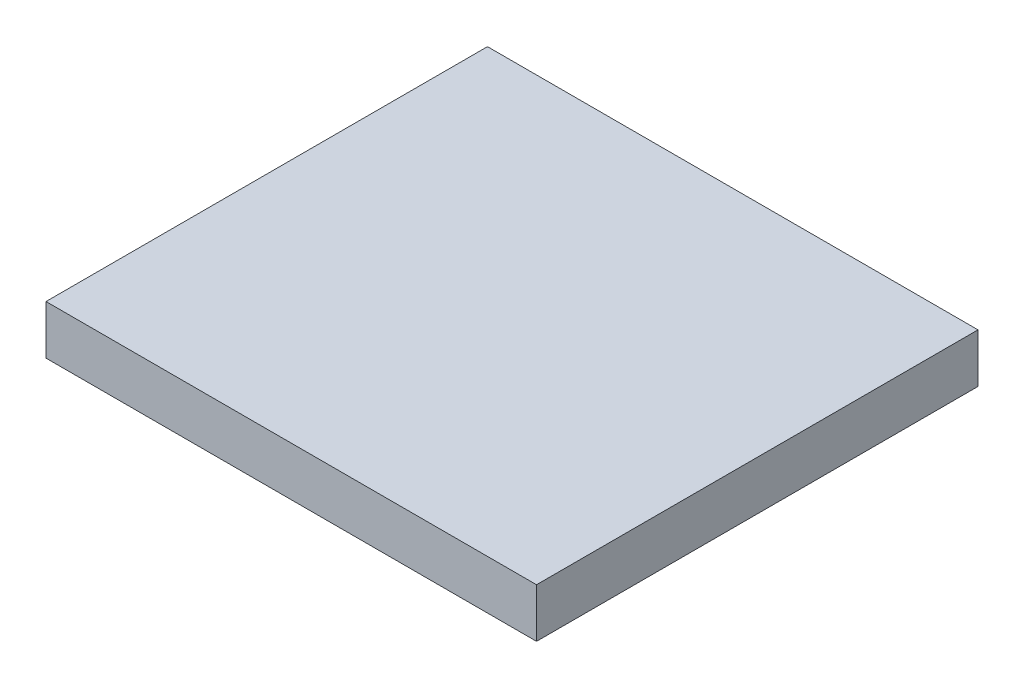
ISO-10303-21;
HEADER;
FILE_DESCRIPTION(('STEP AP214'),'2;1');
FILE_NAME('part.step','',(''),(''),'','','');
FILE_SCHEMA(('AUTOMOTIVE_DESIGN { 1 0 10303 214 1 1 1 1 }'));
ENDSEC;
DATA;
#1=APPLICATION_CONTEXT('core data for automotive mechanical design processes');
#2=APPLICATION_PROTOCOL_DEFINITION('international standard','automotive_design',2000,#1);
#3=PRODUCT_CONTEXT('',#1,'mechanical');
#4=PRODUCT('Part','Part','',(#3));
#5=PRODUCT_RELATED_PRODUCT_CATEGORY('part','',(#4));
#6=PRODUCT_DEFINITION_FORMATION('','',#4);
#7=PRODUCT_DEFINITION_CONTEXT('part definition',#1,'design');
#8=PRODUCT_DEFINITION('design','',#6,#7);
#9=PRODUCT_DEFINITION_SHAPE('','',#8);
#10=(LENGTH_UNIT() NAMED_UNIT(*) SI_UNIT(.MILLI.,.METRE.));
#11=(NAMED_UNIT(*) PLANE_ANGLE_UNIT() SI_UNIT($,.RADIAN.));
#12=(NAMED_UNIT(*) SI_UNIT($,.STERADIAN.) SOLID_ANGLE_UNIT());
#13=UNCERTAINTY_MEASURE_WITH_UNIT(LENGTH_MEASURE(1.E-05),#10,'distance_accuracy_value','');
#14=(GEOMETRIC_REPRESENTATION_CONTEXT(3) GLOBAL_UNCERTAINTY_ASSIGNED_CONTEXT((#13)) GLOBAL_UNIT_ASSIGNED_CONTEXT((#10,
#11,#12)) REPRESENTATION_CONTEXT('',''));
#15=CARTESIAN_POINT('',(0.,0.,0.));
#16=DIRECTION('',(0.,0.,1.));
#17=DIRECTION('',(1.,0.,0.));
#18=AXIS2_PLACEMENT_3D('',#15,#16,#17);
#19=CARTESIAN_POINT('',(0.,10.,0.));
#20=DIRECTION('',(1.,0.,0.));
#21=DIRECTION('',(0.,0.,-1.));
#22=AXIS2_PLACEMENT_3D('',#19,#20,#21);
#23=PLANE('',#22);
#24=DIRECTION('',(0.,0.,1.));
#25=VECTOR('',#24,1.);
#26=CARTESIAN_POINT('',(0.,0.,0.));
#27=LINE('',#26,#25);
#28=CARTESIAN_POINT('',(0.,0.,-90.));
#29=VERTEX_POINT('',#28);
#30=CARTESIAN_POINT('',(0.,0.,0.));
#31=VERTEX_POINT('',#30);
#32=EDGE_CURVE('E105',#29,#31,#27,.T.);
#33=ORIENTED_EDGE('',*,*,#32,.T.);
#34=DIRECTION('',(0.,-1.,0.));
#35=VECTOR('',#34,1.);
#36=CARTESIAN_POINT('',(0.,10.,0.));
#37=LINE('',#36,#35);
#38=CARTESIAN_POINT('',(0.,10.,0.));
#39=VERTEX_POINT('',#38);
#40=EDGE_CURVE('E11',#39,#31,#37,.T.);
#41=ORIENTED_EDGE('',*,*,#40,.F.);
#42=DIRECTION('',(0.,0.,1.));
#43=VECTOR('',#42,1.);
#44=CARTESIAN_POINT('',(0.,10.,0.));
#45=LINE('',#44,#43);
#46=CARTESIAN_POINT('',(0.,10.,-90.));
#47=VERTEX_POINT('',#46);
#48=EDGE_CURVE('E89',#47,#39,#45,.T.);
#49=ORIENTED_EDGE('',*,*,#48,.F.);
#50=DIRECTION('',(0.,-1.,0.));
#51=VECTOR('',#50,1.);
#52=CARTESIAN_POINT('',(0.,10.,-90.));
#53=LINE('',#52,#51);
#54=EDGE_CURVE('E101',#47,#29,#53,.T.);
#55=ORIENTED_EDGE('',*,*,#54,.T.);
#56=EDGE_LOOP('',(#33,#41,#49,#55));
#57=FACE_BOUND('',#56,.T.);
#58=ADVANCED_FACE('F37',(#57),#23,.F.);
#59=CARTESIAN_POINT('',(0.,10.,0.));
#60=DIRECTION('',(0.,0.,-1.));
#61=DIRECTION('',(-1.,0.,0.));
#62=AXIS2_PLACEMENT_3D('',#59,#60,#61);
#63=PLANE('',#62);
#64=DIRECTION('',(1.,0.,0.));
#65=VECTOR('',#64,1.);
#66=CARTESIAN_POINT('',(0.,0.,0.));
#67=LINE('',#66,#65);
#68=CARTESIAN_POINT('',(100.,0.,0.));
#69=VERTEX_POINT('',#68);
#70=EDGE_CURVE('E94',#31,#69,#67,.T.);
#71=ORIENTED_EDGE('',*,*,#70,.T.);
#72=DIRECTION('',(0.,-1.,0.));
#73=VECTOR('',#72,1.);
#74=CARTESIAN_POINT('',(100.,10.,0.));
#75=LINE('',#74,#73);
#76=CARTESIAN_POINT('',(100.,10.,0.));
#77=VERTEX_POINT('',#76);
#78=EDGE_CURVE('E46',#77,#69,#75,.T.);
#79=ORIENTED_EDGE('',*,*,#78,.F.);
#80=DIRECTION('',(1.,0.,0.));
#81=VECTOR('',#80,1.);
#82=CARTESIAN_POINT('',(0.,10.,0.));
#83=LINE('',#82,#81);
#84=EDGE_CURVE('E84',#39,#77,#83,.T.);
#85=ORIENTED_EDGE('',*,*,#84,.F.);
#86=ORIENTED_EDGE('',*,*,#40,.T.);
#87=EDGE_LOOP('',(#71,#79,#85,#86));
#88=FACE_BOUND('',#87,.T.);
#89=ADVANCED_FACE('F93',(#88),#63,.F.);
#90=CARTESIAN_POINT('',(100.,10.,0.));
#91=DIRECTION('',(-1.,0.,0.));
#92=DIRECTION('',(0.,0.,1.));
#93=AXIS2_PLACEMENT_3D('',#90,#91,#92);
#94=PLANE('',#93);
#95=DIRECTION('',(0.,0.,-1.));
#96=VECTOR('',#95,1.);
#97=CARTESIAN_POINT('',(100.,0.,0.));
#98=LINE('',#97,#96);
#99=CARTESIAN_POINT('',(100.,0.,-90.));
#100=VERTEX_POINT('',#99);
#101=EDGE_CURVE('E71',#69,#100,#98,.T.);
#102=ORIENTED_EDGE('',*,*,#101,.T.);
#103=DIRECTION('',(0.,-1.,0.));
#104=VECTOR('',#103,1.);
#105=CARTESIAN_POINT('',(100.,10.,-90.));
#106=LINE('',#105,#104);
#107=CARTESIAN_POINT('',(100.,10.,-90.));
#108=VERTEX_POINT('',#107);
#109=EDGE_CURVE('E96',#108,#100,#106,.T.);
#110=ORIENTED_EDGE('',*,*,#109,.F.);
#111=DIRECTION('',(0.,0.,-1.));
#112=VECTOR('',#111,1.);
#113=CARTESIAN_POINT('',(100.,10.,0.));
#114=LINE('',#113,#112);
#115=EDGE_CURVE('E87',#77,#108,#114,.T.);
#116=ORIENTED_EDGE('',*,*,#115,.F.);
#117=ORIENTED_EDGE('',*,*,#78,.T.);
#118=EDGE_LOOP('',(#102,#110,#116,#117));
#119=FACE_BOUND('',#118,.T.);
#120=ADVANCED_FACE('F97',(#119),#94,.F.);
#121=CARTESIAN_POINT('',(0.,10.,-90.));
#122=DIRECTION('',(0.,0.,1.));
#123=DIRECTION('',(1.,0.,0.));
#124=AXIS2_PLACEMENT_3D('',#121,#122,#123);
#125=PLANE('',#124);
#126=DIRECTION('',(-1.,0.,0.));
#127=VECTOR('',#126,1.);
#128=CARTESIAN_POINT('',(0.,0.,-90.));
#129=LINE('',#128,#127);
#130=EDGE_CURVE('E77',#100,#29,#129,.T.);
#131=ORIENTED_EDGE('',*,*,#130,.T.);
#132=ORIENTED_EDGE('',*,*,#54,.F.);
#133=DIRECTION('',(-1.,0.,0.));
#134=VECTOR('',#133,1.);
#135=CARTESIAN_POINT('',(0.,10.,-90.));
#136=LINE('',#135,#134);
#137=EDGE_CURVE('E54',#108,#47,#136,.T.);
#138=ORIENTED_EDGE('',*,*,#137,.F.);
#139=ORIENTED_EDGE('',*,*,#109,.T.);
#140=EDGE_LOOP('',(#131,#132,#138,#139));
#141=FACE_BOUND('',#140,.T.);
#142=ADVANCED_FACE('F118',(#141),#125,.F.);
#143=CARTESIAN_POINT('',(0.,10.,0.));
#144=DIRECTION('',(0.,-1.,0.));
#145=DIRECTION('',(0.,0.,-1.));
#146=AXIS2_PLACEMENT_3D('',#143,#144,#145);
#147=PLANE('',#146);
#148=ORIENTED_EDGE('',*,*,#48,.T.);
#149=ORIENTED_EDGE('',*,*,#84,.T.);
#150=ORIENTED_EDGE('',*,*,#115,.T.);
#151=ORIENTED_EDGE('',*,*,#137,.T.);
#152=EDGE_LOOP('',(#148,#149,#150,#151));
#153=FACE_BOUND('',#152,.T.);
#154=ADVANCED_FACE('F85',(#153),#147,.F.);
#155=CARTESIAN_POINT('',(0.,0.,0.));
#156=DIRECTION('',(0.,-1.,0.));
#157=DIRECTION('',(0.,0.,-1.));
#158=AXIS2_PLACEMENT_3D('',#155,#156,#157);
#159=PLANE('',#158);
#160=ORIENTED_EDGE('',*,*,#32,.F.);
#161=ORIENTED_EDGE('',*,*,#130,.F.);
#162=ORIENTED_EDGE('',*,*,#101,.F.);
#163=ORIENTED_EDGE('',*,*,#70,.F.);
#164=EDGE_LOOP('',(#160,#161,#162,#163));
#165=FACE_BOUND('',#164,.T.);
#166=ADVANCED_FACE('F121',(#165),#159,.T.);
#167=CLOSED_SHELL('',(#58,#89,#120,#142,#154,#166));
#168=MANIFOLD_SOLID_BREP('B2',#167);
#169=ADVANCED_BREP_SHAPE_REPRESENTATION('',(#18,#168),#14);
#170=SHAPE_DEFINITION_REPRESENTATION(#9,#169);
ENDSEC;
END-ISO-10303-21;
